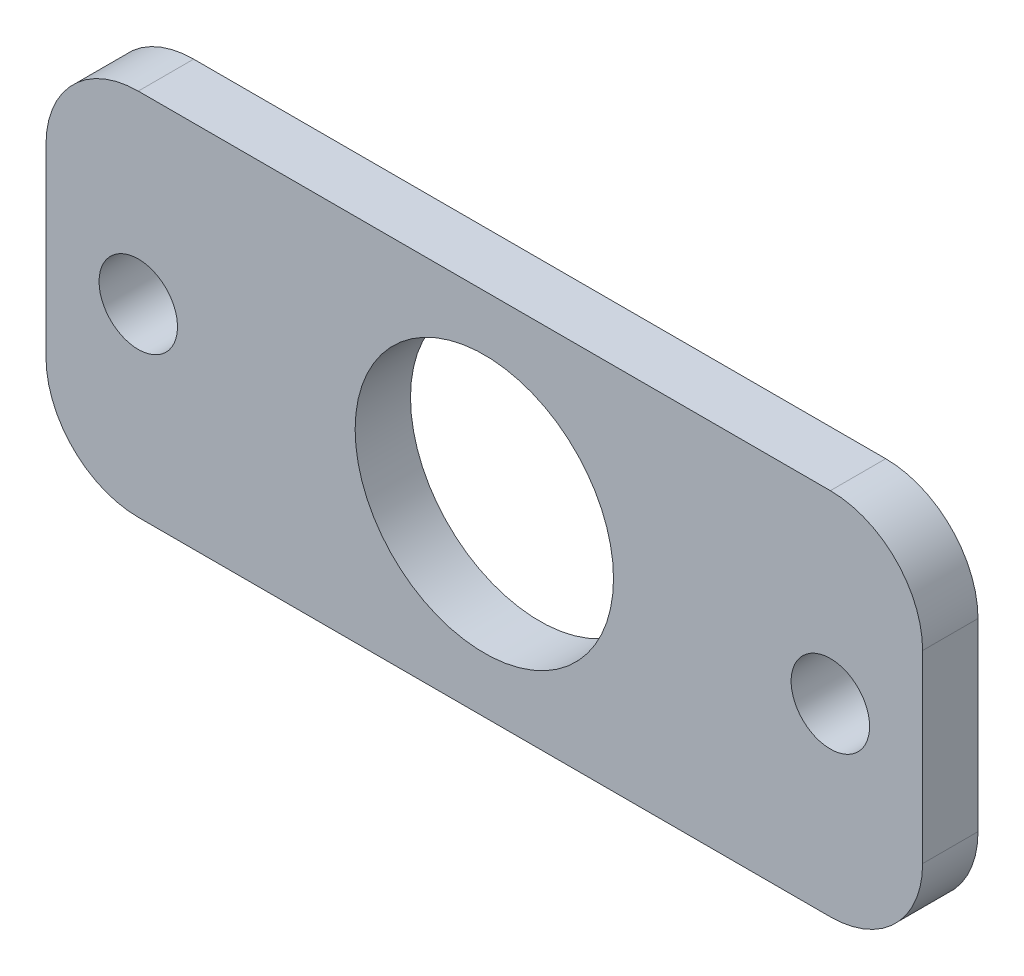
ISO-10303-21;
HEADER;
FILE_DESCRIPTION(('STEP AP214'),'2;1');
FILE_NAME('part.step','',(''),(''),'','','');
FILE_SCHEMA(('AUTOMOTIVE_DESIGN { 1 0 10303 214 1 1 1 1 }'));
ENDSEC;
DATA;
#1=APPLICATION_CONTEXT('core data for automotive mechanical design processes');
#2=APPLICATION_PROTOCOL_DEFINITION('international standard','automotive_design',2000,#1);
#3=PRODUCT_CONTEXT('',#1,'mechanical');
#4=PRODUCT('Part','Part','',(#3));
#5=PRODUCT_RELATED_PRODUCT_CATEGORY('part','',(#4));
#6=PRODUCT_DEFINITION_FORMATION('','',#4);
#7=PRODUCT_DEFINITION_CONTEXT('part definition',#1,'design');
#8=PRODUCT_DEFINITION('design','',#6,#7);
#9=PRODUCT_DEFINITION_SHAPE('','',#8);
#10=(LENGTH_UNIT() NAMED_UNIT(*) SI_UNIT(.MILLI.,.METRE.));
#11=(NAMED_UNIT(*) PLANE_ANGLE_UNIT() SI_UNIT($,.RADIAN.));
#12=(NAMED_UNIT(*) SI_UNIT($,.STERADIAN.) SOLID_ANGLE_UNIT());
#13=UNCERTAINTY_MEASURE_WITH_UNIT(LENGTH_MEASURE(1.E-05),#10,'distance_accuracy_value','');
#14=(GEOMETRIC_REPRESENTATION_CONTEXT(3) GLOBAL_UNCERTAINTY_ASSIGNED_CONTEXT((#13)) GLOBAL_UNIT_ASSIGNED_CONTEXT((#10,
#11,#12)) REPRESENTATION_CONTEXT('',''));
#15=CARTESIAN_POINT('',(0.,0.,0.));
#16=DIRECTION('',(0.,0.,1.));
#17=DIRECTION('',(1.,0.,0.));
#18=AXIS2_PLACEMENT_3D('',#15,#16,#17);
#19=CARTESIAN_POINT('',(0.,0.,6.));
#20=DIRECTION('',(0.,0.,-1.));
#21=DIRECTION('',(-1.,0.,0.));
#22=AXIS2_PLACEMENT_3D('',#19,#20,#21);
#23=PLANE('',#22);
#24=DIRECTION('',(0.,1.,0.));
#25=VECTOR('',#24,1.);
#26=CARTESIAN_POINT('',(395.,0.,6.));
#27=LINE('',#26,#25);
#28=CARTESIAN_POINT('',(395.,-30.,6.));
#29=VERTEX_POINT('',#28);
#30=CARTESIAN_POINT('',(395.,-10.,6.));
#31=VERTEX_POINT('',#30);
#32=EDGE_CURVE('E138',#29,#31,#27,.T.);
#33=ORIENTED_EDGE('',*,*,#32,.T.);
#34=CARTESIAN_POINT('',(385.,-10.,6.));
#35=DIRECTION('',(0.,0.,-1.));
#36=DIRECTION('',(-1.,0.,0.));
#37=AXIS2_PLACEMENT_3D('',#34,#35,#36);
#38=CIRCLE('',#37,10.);
#39=CARTESIAN_POINT('',(385.,0.,6.));
#40=VERTEX_POINT('',#39);
#41=EDGE_CURVE('E153',#31,#40,#38,.F.);
#42=ORIENTED_EDGE('',*,*,#41,.T.);
#43=DIRECTION('',(-1.,0.,0.));
#44=VECTOR('',#43,1.);
#45=CARTESIAN_POINT('',(395.,0.,6.));
#46=LINE('',#45,#44);
#47=CARTESIAN_POINT('',(310.,0.,6.));
#48=VERTEX_POINT('',#47);
#49=EDGE_CURVE('E120',#40,#48,#46,.T.);
#50=ORIENTED_EDGE('',*,*,#49,.T.);
#51=CARTESIAN_POINT('',(310.,-9.99999999999999,6.));
#52=DIRECTION('',(0.,0.,-1.));
#53=DIRECTION('',(-1.,0.,0.));
#54=AXIS2_PLACEMENT_3D('',#51,#52,#53);
#55=CIRCLE('',#54,10.);
#56=CARTESIAN_POINT('',(300.,-9.99999999999999,6.));
#57=VERTEX_POINT('',#56);
#58=EDGE_CURVE('E148',#48,#57,#55,.F.);
#59=ORIENTED_EDGE('',*,*,#58,.T.);
#60=DIRECTION('',(0.,-1.,0.));
#61=VECTOR('',#60,1.);
#62=CARTESIAN_POINT('',(300.,0.,6.));
#63=LINE('',#62,#61);
#64=CARTESIAN_POINT('',(300.,-30.,6.));
#65=VERTEX_POINT('',#64);
#66=EDGE_CURVE('E164',#57,#65,#63,.T.);
#67=ORIENTED_EDGE('',*,*,#66,.T.);
#68=CARTESIAN_POINT('',(310.,-30.,6.));
#69=DIRECTION('',(0.,0.,-1.));
#70=DIRECTION('',(-1.,0.,0.));
#71=AXIS2_PLACEMENT_3D('',#68,#69,#70);
#72=CIRCLE('',#71,10.);
#73=CARTESIAN_POINT('',(310.,-40.,6.));
#74=VERTEX_POINT('',#73);
#75=EDGE_CURVE('E56',#65,#74,#72,.F.);
#76=ORIENTED_EDGE('',*,*,#75,.T.);
#77=DIRECTION('',(1.,0.,0.));
#78=VECTOR('',#77,1.);
#79=CARTESIAN_POINT('',(395.,-40.,6.));
#80=LINE('',#79,#78);
#81=CARTESIAN_POINT('',(385.,-40.,6.));
#82=VERTEX_POINT('',#81);
#83=EDGE_CURVE('E139',#74,#82,#80,.T.);
#84=ORIENTED_EDGE('',*,*,#83,.T.);
#85=CARTESIAN_POINT('',(385.,-30.,6.));
#86=DIRECTION('',(0.,0.,-1.));
#87=DIRECTION('',(-1.,0.,0.));
#88=AXIS2_PLACEMENT_3D('',#85,#86,#87);
#89=CIRCLE('',#88,10.);
#90=EDGE_CURVE('E151',#82,#29,#89,.F.);
#91=ORIENTED_EDGE('',*,*,#90,.T.);
#92=EDGE_LOOP('',(#33,#42,#50,#59,#67,#76,#84,#91));
#93=FACE_BOUND('',#92,.T.);
#94=CARTESIAN_POINT('',(347.5,-20.,6.));
#95=DIRECTION('',(0.,0.,1.));
#96=DIRECTION('',(1.,0.,0.));
#97=AXIS2_PLACEMENT_3D('',#94,#95,#96);
#98=CIRCLE('',#97,14.);
#99=CARTESIAN_POINT('',(361.5,-20.,6.));
#100=VERTEX_POINT('',#99);
#101=EDGE_CURVE('E133',#100,#100,#98,.T.);
#102=ORIENTED_EDGE('',*,*,#101,.F.);
#103=EDGE_LOOP('',(#102));
#104=FACE_BOUND('',#103,.T.);
#105=CARTESIAN_POINT('',(385.,-20.,6.));
#106=DIRECTION('',(0.,0.,1.));
#107=DIRECTION('',(1.,0.,0.));
#108=AXIS2_PLACEMENT_3D('',#105,#106,#107);
#109=CIRCLE('',#108,4.24999999999995);
#110=CARTESIAN_POINT('',(389.25,-20.,6.));
#111=VERTEX_POINT('',#110);
#112=EDGE_CURVE('E181',#111,#111,#109,.T.);
#113=ORIENTED_EDGE('',*,*,#112,.F.);
#114=EDGE_LOOP('',(#113));
#115=FACE_BOUND('',#114,.T.);
#116=CARTESIAN_POINT('',(310.,-20.,6.));
#117=DIRECTION('',(0.,0.,1.));
#118=DIRECTION('',(-1.,0.,0.));
#119=AXIS2_PLACEMENT_3D('',#116,#117,#118);
#120=CIRCLE('',#119,4.24999999999995);
#121=CARTESIAN_POINT('',(305.75,-20.,6.));
#122=VERTEX_POINT('',#121);
#123=EDGE_CURVE('E187',#122,#122,#120,.T.);
#124=ORIENTED_EDGE('',*,*,#123,.F.);
#125=EDGE_LOOP('',(#124));
#126=FACE_BOUND('',#125,.T.);
#127=ADVANCED_FACE('F34',(#93,#104,#115,#126),#23,.F.);
#128=CARTESIAN_POINT('',(0.,0.,0.));
#129=DIRECTION('',(0.,0.,-1.));
#130=DIRECTION('',(-1.,0.,0.));
#131=AXIS2_PLACEMENT_3D('',#128,#129,#130);
#132=PLANE('',#131);
#133=CARTESIAN_POINT('',(385.,-20.,0.));
#134=DIRECTION('',(0.,0.,1.));
#135=DIRECTION('',(1.,0.,0.));
#136=AXIS2_PLACEMENT_3D('',#133,#134,#135);
#137=CIRCLE('',#136,4.24999999999995);
#138=CARTESIAN_POINT('',(389.25,-20.,0.));
#139=VERTEX_POINT('',#138);
#140=EDGE_CURVE('E184',#139,#139,#137,.T.);
#141=ORIENTED_EDGE('',*,*,#140,.T.);
#142=EDGE_LOOP('',(#141));
#143=FACE_BOUND('',#142,.T.);
#144=DIRECTION('',(-1.,0.,0.));
#145=VECTOR('',#144,1.);
#146=CARTESIAN_POINT('',(395.,0.,0.));
#147=LINE('',#146,#145);
#148=CARTESIAN_POINT('',(385.,0.,0.));
#149=VERTEX_POINT('',#148);
#150=CARTESIAN_POINT('',(310.,0.,0.));
#151=VERTEX_POINT('',#150);
#152=EDGE_CURVE('E117',#149,#151,#147,.T.);
#153=ORIENTED_EDGE('',*,*,#152,.F.);
#154=CARTESIAN_POINT('',(385.,-10.,0.));
#155=DIRECTION('',(0.,0.,-1.));
#156=DIRECTION('',(-1.,0.,0.));
#157=AXIS2_PLACEMENT_3D('',#154,#155,#156);
#158=CIRCLE('',#157,10.);
#159=CARTESIAN_POINT('',(395.,-10.,0.));
#160=VERTEX_POINT('',#159);
#161=EDGE_CURVE('E100',#149,#160,#158,.T.);
#162=ORIENTED_EDGE('',*,*,#161,.T.);
#163=DIRECTION('',(0.,1.,0.));
#164=VECTOR('',#163,1.);
#165=CARTESIAN_POINT('',(395.,0.,0.));
#166=LINE('',#165,#164);
#167=CARTESIAN_POINT('',(395.,-30.,0.));
#168=VERTEX_POINT('',#167);
#169=EDGE_CURVE('E128',#168,#160,#166,.T.);
#170=ORIENTED_EDGE('',*,*,#169,.F.);
#171=CARTESIAN_POINT('',(385.,-30.,0.));
#172=DIRECTION('',(0.,0.,-1.));
#173=DIRECTION('',(-1.,0.,0.));
#174=AXIS2_PLACEMENT_3D('',#171,#172,#173);
#175=CIRCLE('',#174,10.);
#176=CARTESIAN_POINT('',(385.,-40.,0.));
#177=VERTEX_POINT('',#176);
#178=EDGE_CURVE('E111',#168,#177,#175,.T.);
#179=ORIENTED_EDGE('',*,*,#178,.T.);
#180=DIRECTION('',(1.,0.,0.));
#181=VECTOR('',#180,1.);
#182=CARTESIAN_POINT('',(395.,-40.,0.));
#183=LINE('',#182,#181);
#184=CARTESIAN_POINT('',(310.,-40.,0.));
#185=VERTEX_POINT('',#184);
#186=EDGE_CURVE('E131',#185,#177,#183,.T.);
#187=ORIENTED_EDGE('',*,*,#186,.F.);
#188=CARTESIAN_POINT('',(310.,-30.,0.));
#189=DIRECTION('',(0.,0.,-1.));
#190=DIRECTION('',(-1.,0.,0.));
#191=AXIS2_PLACEMENT_3D('',#188,#189,#190);
#192=CIRCLE('',#191,10.);
#193=CARTESIAN_POINT('',(300.,-30.,0.));
#194=VERTEX_POINT('',#193);
#195=EDGE_CURVE('E142',#185,#194,#192,.T.);
#196=ORIENTED_EDGE('',*,*,#195,.T.);
#197=DIRECTION('',(0.,-1.,0.));
#198=VECTOR('',#197,1.);
#199=CARTESIAN_POINT('',(300.,0.,0.));
#200=LINE('',#199,#198);
#201=CARTESIAN_POINT('',(300.,-9.99999999999999,0.));
#202=VERTEX_POINT('',#201);
#203=EDGE_CURVE('E127',#202,#194,#200,.T.);
#204=ORIENTED_EDGE('',*,*,#203,.F.);
#205=CARTESIAN_POINT('',(310.,-9.99999999999999,0.));
#206=DIRECTION('',(0.,0.,-1.));
#207=DIRECTION('',(-1.,0.,0.));
#208=AXIS2_PLACEMENT_3D('',#205,#206,#207);
#209=CIRCLE('',#208,10.);
#210=EDGE_CURVE('E121',#202,#151,#209,.T.);
#211=ORIENTED_EDGE('',*,*,#210,.T.);
#212=EDGE_LOOP('',(#153,#162,#170,#179,#187,#196,#204,#211));
#213=FACE_BOUND('',#212,.T.);
#214=CARTESIAN_POINT('',(347.5,-20.,0.));
#215=DIRECTION('',(0.,0.,1.));
#216=DIRECTION('',(1.,0.,0.));
#217=AXIS2_PLACEMENT_3D('',#214,#215,#216);
#218=CIRCLE('',#217,14.);
#219=CARTESIAN_POINT('',(361.5,-20.,0.));
#220=VERTEX_POINT('',#219);
#221=EDGE_CURVE('E178',#220,#220,#218,.T.);
#222=ORIENTED_EDGE('',*,*,#221,.T.);
#223=EDGE_LOOP('',(#222));
#224=FACE_BOUND('',#223,.T.);
#225=CARTESIAN_POINT('',(310.,-20.,0.));
#226=DIRECTION('',(0.,0.,1.));
#227=DIRECTION('',(-1.,0.,0.));
#228=AXIS2_PLACEMENT_3D('',#225,#226,#227);
#229=CIRCLE('',#228,4.24999999999995);
#230=CARTESIAN_POINT('',(305.75,-20.,0.));
#231=VERTEX_POINT('',#230);
#232=EDGE_CURVE('E190',#231,#231,#229,.T.);
#233=ORIENTED_EDGE('',*,*,#232,.T.);
#234=EDGE_LOOP('',(#233));
#235=FACE_BOUND('',#234,.T.);
#236=ADVANCED_FACE('F124',(#143,#213,#224,#235),#132,.T.);
#237=CARTESIAN_POINT('',(395.,0.,6.));
#238=DIRECTION('',(-1.,0.,0.));
#239=DIRECTION('',(0.,0.,1.));
#240=AXIS2_PLACEMENT_3D('',#237,#238,#239);
#241=PLANE('',#240);
#242=ORIENTED_EDGE('',*,*,#169,.T.);
#243=DIRECTION('',(0.,0.,-1.));
#244=VECTOR('',#243,1.);
#245=CARTESIAN_POINT('',(395.,-10.,6.));
#246=LINE('',#245,#244);
#247=EDGE_CURVE('E105',#160,#31,#246,.F.);
#248=ORIENTED_EDGE('',*,*,#247,.T.);
#249=ORIENTED_EDGE('',*,*,#32,.F.);
#250=DIRECTION('',(0.,0.,-1.));
#251=VECTOR('',#250,1.);
#252=CARTESIAN_POINT('',(395.,-30.,6.));
#253=LINE('',#252,#251);
#254=EDGE_CURVE('E110',#29,#168,#253,.T.);
#255=ORIENTED_EDGE('',*,*,#254,.T.);
#256=EDGE_LOOP('',(#242,#248,#249,#255));
#257=FACE_BOUND('',#256,.T.);
#258=ADVANCED_FACE('F204',(#257),#241,.F.);
#259=CARTESIAN_POINT('',(395.,0.,6.));
#260=DIRECTION('',(0.,-1.,0.));
#261=DIRECTION('',(1.,0.,0.));
#262=AXIS2_PLACEMENT_3D('',#259,#260,#261);
#263=PLANE('',#262);
#264=ORIENTED_EDGE('',*,*,#49,.F.);
#265=DIRECTION('',(0.,0.,-1.));
#266=VECTOR('',#265,1.);
#267=CARTESIAN_POINT('',(385.,0.,6.));
#268=LINE('',#267,#266);
#269=EDGE_CURVE('E104',#40,#149,#268,.T.);
#270=ORIENTED_EDGE('',*,*,#269,.T.);
#271=ORIENTED_EDGE('',*,*,#152,.T.);
#272=DIRECTION('',(0.,0.,-1.));
#273=VECTOR('',#272,1.);
#274=CARTESIAN_POINT('',(310.,0.,6.));
#275=LINE('',#274,#273);
#276=EDGE_CURVE('E122',#151,#48,#275,.F.);
#277=ORIENTED_EDGE('',*,*,#276,.T.);
#278=EDGE_LOOP('',(#264,#270,#271,#277));
#279=FACE_BOUND('',#278,.T.);
#280=ADVANCED_FACE('F116',(#279),#263,.F.);
#281=CARTESIAN_POINT('',(300.,0.,6.));
#282=DIRECTION('',(1.,0.,0.));
#283=DIRECTION('',(0.,0.,-1.));
#284=AXIS2_PLACEMENT_3D('',#281,#282,#283);
#285=PLANE('',#284);
#286=ORIENTED_EDGE('',*,*,#203,.T.);
#287=DIRECTION('',(0.,0.,-1.));
#288=VECTOR('',#287,1.);
#289=CARTESIAN_POINT('',(300.,-30.,6.));
#290=LINE('',#289,#288);
#291=EDGE_CURVE('E11',#194,#65,#290,.F.);
#292=ORIENTED_EDGE('',*,*,#291,.T.);
#293=ORIENTED_EDGE('',*,*,#66,.F.);
#294=DIRECTION('',(0.,0.,-1.));
#295=VECTOR('',#294,1.);
#296=CARTESIAN_POINT('',(300.,-9.99999999999999,6.));
#297=LINE('',#296,#295);
#298=EDGE_CURVE('E42',#57,#202,#297,.T.);
#299=ORIENTED_EDGE('',*,*,#298,.T.);
#300=EDGE_LOOP('',(#286,#292,#293,#299));
#301=FACE_BOUND('',#300,.T.);
#302=ADVANCED_FACE('F162',(#301),#285,.F.);
#303=CARTESIAN_POINT('',(395.,-40.,6.));
#304=DIRECTION('',(0.,1.,0.));
#305=DIRECTION('',(-1.,0.,0.));
#306=AXIS2_PLACEMENT_3D('',#303,#304,#305);
#307=PLANE('',#306);
#308=ORIENTED_EDGE('',*,*,#186,.T.);
#309=DIRECTION('',(0.,0.,-1.));
#310=VECTOR('',#309,1.);
#311=CARTESIAN_POINT('',(385.,-40.,6.));
#312=LINE('',#311,#310);
#313=EDGE_CURVE('E49',#177,#82,#312,.F.);
#314=ORIENTED_EDGE('',*,*,#313,.T.);
#315=ORIENTED_EDGE('',*,*,#83,.F.);
#316=DIRECTION('',(0.,0.,-1.));
#317=VECTOR('',#316,1.);
#318=CARTESIAN_POINT('',(310.,-40.,6.));
#319=LINE('',#318,#317);
#320=EDGE_CURVE('E155',#74,#185,#319,.T.);
#321=ORIENTED_EDGE('',*,*,#320,.T.);
#322=EDGE_LOOP('',(#308,#314,#315,#321));
#323=FACE_BOUND('',#322,.T.);
#324=ADVANCED_FACE('F171',(#323),#307,.F.);
#325=CARTESIAN_POINT('',(347.5,-20.,6.));
#326=DIRECTION('',(0.,0.,-1.));
#327=DIRECTION('',(-1.,0.,0.));
#328=AXIS2_PLACEMENT_3D('',#325,#326,#327);
#329=CYLINDRICAL_SURFACE('',#328,14.);
#330=ORIENTED_EDGE('',*,*,#101,.T.);
#331=EDGE_LOOP('',(#330));
#332=FACE_BOUND('',#331,.T.);
#333=ORIENTED_EDGE('',*,*,#221,.F.);
#334=EDGE_LOOP('',(#333));
#335=FACE_BOUND('',#334,.T.);
#336=ADVANCED_FACE('F209',(#332,#335),#329,.F.);
#337=CARTESIAN_POINT('',(385.,-20.,6.));
#338=DIRECTION('',(0.,0.,-1.));
#339=DIRECTION('',(-1.,0.,0.));
#340=AXIS2_PLACEMENT_3D('',#337,#338,#339);
#341=CYLINDRICAL_SURFACE('',#340,4.24999999999995);
#342=ORIENTED_EDGE('',*,*,#112,.T.);
#343=EDGE_LOOP('',(#342));
#344=FACE_BOUND('',#343,.T.);
#345=ORIENTED_EDGE('',*,*,#140,.F.);
#346=EDGE_LOOP('',(#345));
#347=FACE_BOUND('',#346,.T.);
#348=ADVANCED_FACE('F295',(#344,#347),#341,.F.);
#349=CARTESIAN_POINT('',(310.,-20.,6.));
#350=DIRECTION('',(0.,0.,-1.));
#351=DIRECTION('',(-1.,0.,0.));
#352=AXIS2_PLACEMENT_3D('',#349,#350,#351);
#353=CYLINDRICAL_SURFACE('',#352,4.24999999999995);
#354=ORIENTED_EDGE('',*,*,#123,.T.);
#355=EDGE_LOOP('',(#354));
#356=FACE_BOUND('',#355,.T.);
#357=ORIENTED_EDGE('',*,*,#232,.F.);
#358=EDGE_LOOP('',(#357));
#359=FACE_BOUND('',#358,.T.);
#360=ADVANCED_FACE('F196',(#356,#359),#353,.F.);
#361=CARTESIAN_POINT('',(385.,-10.,6.));
#362=DIRECTION('',(0.,0.,-1.));
#363=DIRECTION('',(-1.,0.,0.));
#364=AXIS2_PLACEMENT_3D('',#361,#362,#363);
#365=CYLINDRICAL_SURFACE('',#364,10.);
#366=ORIENTED_EDGE('',*,*,#41,.F.);
#367=ORIENTED_EDGE('',*,*,#247,.F.);
#368=ORIENTED_EDGE('',*,*,#161,.F.);
#369=ORIENTED_EDGE('',*,*,#269,.F.);
#370=EDGE_LOOP('',(#366,#367,#368,#369));
#371=FACE_BOUND('',#370,.T.);
#372=ADVANCED_FACE('F103',(#371),#365,.T.);
#373=CARTESIAN_POINT('',(385.,-30.,6.));
#374=DIRECTION('',(0.,0.,-1.));
#375=DIRECTION('',(-1.,0.,0.));
#376=AXIS2_PLACEMENT_3D('',#373,#374,#375);
#377=CYLINDRICAL_SURFACE('',#376,10.);
#378=ORIENTED_EDGE('',*,*,#90,.F.);
#379=ORIENTED_EDGE('',*,*,#313,.F.);
#380=ORIENTED_EDGE('',*,*,#178,.F.);
#381=ORIENTED_EDGE('',*,*,#254,.F.);
#382=EDGE_LOOP('',(#378,#379,#380,#381));
#383=FACE_BOUND('',#382,.T.);
#384=ADVANCED_FACE('F223',(#383),#377,.T.);
#385=CARTESIAN_POINT('',(310.,-30.,6.));
#386=DIRECTION('',(0.,0.,-1.));
#387=DIRECTION('',(-1.,0.,0.));
#388=AXIS2_PLACEMENT_3D('',#385,#386,#387);
#389=CYLINDRICAL_SURFACE('',#388,10.);
#390=ORIENTED_EDGE('',*,*,#75,.F.);
#391=ORIENTED_EDGE('',*,*,#291,.F.);
#392=ORIENTED_EDGE('',*,*,#195,.F.);
#393=ORIENTED_EDGE('',*,*,#320,.F.);
#394=EDGE_LOOP('',(#390,#391,#392,#393));
#395=FACE_BOUND('',#394,.T.);
#396=ADVANCED_FACE('F170',(#395),#389,.T.);
#397=CARTESIAN_POINT('',(310.,-9.99999999999999,6.));
#398=DIRECTION('',(0.,0.,-1.));
#399=DIRECTION('',(-1.,0.,0.));
#400=AXIS2_PLACEMENT_3D('',#397,#398,#399);
#401=CYLINDRICAL_SURFACE('',#400,10.);
#402=ORIENTED_EDGE('',*,*,#58,.F.);
#403=ORIENTED_EDGE('',*,*,#276,.F.);
#404=ORIENTED_EDGE('',*,*,#210,.F.);
#405=ORIENTED_EDGE('',*,*,#298,.F.);
#406=EDGE_LOOP('',(#402,#403,#404,#405));
#407=FACE_BOUND('',#406,.T.);
#408=ADVANCED_FACE('F36',(#407),#401,.T.);
#409=CLOSED_SHELL('',(#127,#236,#258,#280,#302,#324,#336,#348,#360,#372,#384,#396,#408));
#410=MANIFOLD_SOLID_BREP('B2',#409);
#411=ADVANCED_BREP_SHAPE_REPRESENTATION('',(#18,#410),#14);
#412=SHAPE_DEFINITION_REPRESENTATION(#9,#411);
ENDSEC;
END-ISO-10303-21;
